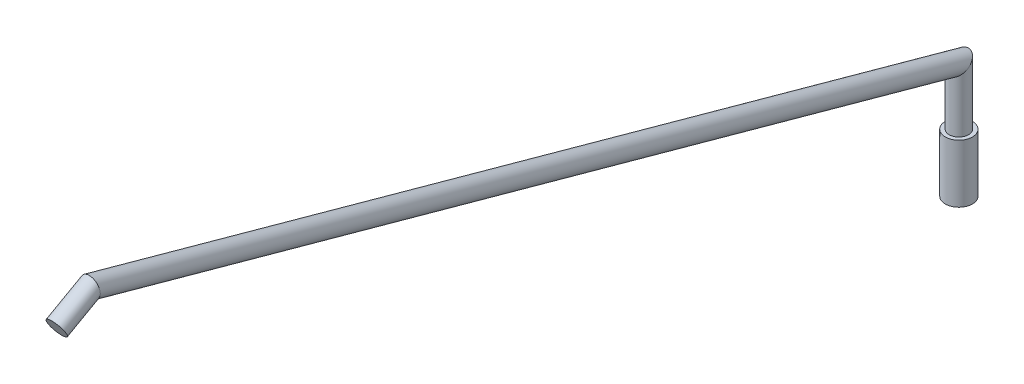
ISO-10303-21;
HEADER;
FILE_DESCRIPTION(('STEP AP214'),'2;1');
FILE_NAME('part.step','',(''),(''),'','','');
FILE_SCHEMA(('AUTOMOTIVE_DESIGN { 1 0 10303 214 1 1 1 1 }'));
ENDSEC;
DATA;
#1=APPLICATION_CONTEXT('core data for automotive mechanical design processes');
#2=APPLICATION_PROTOCOL_DEFINITION('international standard','automotive_design',2000,#1);
#3=PRODUCT_CONTEXT('',#1,'mechanical');
#4=PRODUCT('Part','Part','',(#3));
#5=PRODUCT_RELATED_PRODUCT_CATEGORY('part','',(#4));
#6=PRODUCT_DEFINITION_FORMATION('','',#4);
#7=PRODUCT_DEFINITION_CONTEXT('part definition',#1,'design');
#8=PRODUCT_DEFINITION('design','',#6,#7);
#9=PRODUCT_DEFINITION_SHAPE('','',#8);
#10=(LENGTH_UNIT() NAMED_UNIT(*) SI_UNIT(.MILLI.,.METRE.));
#11=(NAMED_UNIT(*) PLANE_ANGLE_UNIT() SI_UNIT($,.RADIAN.));
#12=(NAMED_UNIT(*) SI_UNIT($,.STERADIAN.) SOLID_ANGLE_UNIT());
#13=UNCERTAINTY_MEASURE_WITH_UNIT(LENGTH_MEASURE(1.E-05),#10,'distance_accuracy_value','');
#14=(GEOMETRIC_REPRESENTATION_CONTEXT(3) GLOBAL_UNCERTAINTY_ASSIGNED_CONTEXT((#13)) GLOBAL_UNIT_ASSIGNED_CONTEXT((#10,
#11,#12)) REPRESENTATION_CONTEXT('',''));
#15=CARTESIAN_POINT('',(0.,0.,0.));
#16=DIRECTION('',(0.,0.,1.));
#17=DIRECTION('',(1.,0.,0.));
#18=AXIS2_PLACEMENT_3D('',#15,#16,#17);
#19=CARTESIAN_POINT('',(0.,0.,0.));
#20=DIRECTION('',(0.,1.,0.));
#21=DIRECTION('',(0.,0.,1.));
#22=AXIS2_PLACEMENT_3D('',#19,#20,#21);
#23=CYLINDRICAL_SURFACE('',#22,2.5);
#24=CARTESIAN_POINT('',(0.,30.,0.));
#25=DIRECTION('',(0.,0.795616753938226,0.605800281324465));
#26=DIRECTION('',(0.,0.605800281324465,-0.795616753938226));
#27=AXIS2_PLACEMENT_3D('',#24,#25,#26);
#28=ELLIPSE('',#27,3.1422163844907,2.5);
#29=CARTESIAN_POINT('',(0.,31.9035555697068,-2.50000000000003));
#30=VERTEX_POINT('',#29);
#31=EDGE_CURVE('E10',#30,#30,#28,.F.);
#32=ORIENTED_EDGE('',*,*,#31,.T.);
#33=EDGE_LOOP('',(#32));
#34=FACE_BOUND('',#33,.T.);
#35=CARTESIAN_POINT('',(0.,15.,0.));
#36=DIRECTION('',(0.,-1.,0.));
#37=DIRECTION('',(0.,0.,-1.));
#38=AXIS2_PLACEMENT_3D('',#35,#36,#37);
#39=CIRCLE('',#38,2.5);
#40=CARTESIAN_POINT('',(0.,15.,-2.50000000000003));
#41=VERTEX_POINT('',#40);
#42=EDGE_CURVE('E38',#41,#41,#39,.F.);
#43=ORIENTED_EDGE('',*,*,#42,.T.);
#44=EDGE_LOOP('',(#43));
#45=FACE_BOUND('',#44,.T.);
#46=ADVANCED_FACE('F34',(#34,#45),#23,.T.);
#47=CARTESIAN_POINT('',(0.,87.,233.));
#48=DIRECTION('',(0.,-0.48904171388526,0.872260398092317));
#49=DIRECTION('',(0.,-0.872260398092317,-0.48904171388526));
#50=AXIS2_PLACEMENT_3D('',#47,#48,#49);
#51=PLANE('',#50);
#52=CARTESIAN_POINT('',(0.,87.,233.));
#53=DIRECTION('',(0.,-0.48904171388526,0.872260398092317));
#54=DIRECTION('',(0.,-0.872260398092317,-0.48904171388526));
#55=AXIS2_PLACEMENT_3D('',#52,#53,#54);
#56=CIRCLE('',#55,2.5);
#57=CARTESIAN_POINT('',(0.,84.8193490047692,231.777395715287));
#58=VERTEX_POINT('',#57);
#59=EDGE_CURVE('E47',#58,#58,#56,.T.);
#60=ORIENTED_EDGE('',*,*,#59,.T.);
#61=EDGE_LOOP('',(#60));
#62=FACE_BOUND('',#61,.T.);
#63=ADVANCED_FACE('F36',(#62),#51,.T.);
#64=CARTESIAN_POINT('',(0.,92.492326701668,223.203823233832));
#65=DIRECTION('',(0.,-0.48904171388526,0.872260398092317));
#66=DIRECTION('',(0.,-0.872260398092317,-0.48904171388526));
#67=AXIS2_PLACEMENT_3D('',#64,#65,#66);
#68=CYLINDRICAL_SURFACE('',#67,2.5);
#69=CARTESIAN_POINT('',(0.,91.8904171388527,224.277396019077));
#70=DIRECTION('',(0.,-0.120574493036413,0.992704282064408));
#71=DIRECTION('',(0.,0.992704282064408,0.120574493036413));
#72=AXIS2_PLACEMENT_3D('',#69,#70,#71);
#73=ELLIPSE('',#72,2.70310425545348,2.5);
#74=CARTESIAN_POINT('',(0.,94.5738003081078,224.603321444303));
#75=VERTEX_POINT('',#74);
#76=EDGE_CURVE('E42',#75,#75,#73,.F.);
#77=ORIENTED_EDGE('',*,*,#76,.F.);
#78=EDGE_LOOP('',(#77));
#79=FACE_BOUND('',#78,.T.);
#80=ORIENTED_EDGE('',*,*,#59,.F.);
#81=EDGE_LOOP('',(#80));
#82=FACE_BOUND('',#81,.T.);
#83=ADVANCED_FACE('F78',(#79,#82),#68,.T.);
#84=CARTESIAN_POINT('',(0.,29.4163932293558,-2.1148638653629));
#85=DIRECTION('',(0.,0.266012038294399,0.963969706724469));
#86=DIRECTION('',(0.,-0.963969706724469,0.266012038294399));
#87=AXIS2_PLACEMENT_3D('',#84,#85,#86);
#88=CYLINDRICAL_SURFACE('',#87,2.5);
#89=ORIENTED_EDGE('',*,*,#31,.F.);
#90=EDGE_LOOP('',(#89));
#91=FACE_BOUND('',#90,.T.);
#92=ORIENTED_EDGE('',*,*,#76,.T.);
#93=EDGE_LOOP('',(#92));
#94=FACE_BOUND('',#93,.T.);
#95=ADVANCED_FACE('F70',(#91,#94),#88,.T.);
#96=CARTESIAN_POINT('',(0.,15.,0.));
#97=DIRECTION('',(0.,-1.,0.));
#98=DIRECTION('',(0.,0.,-1.));
#99=AXIS2_PLACEMENT_3D('',#96,#97,#98);
#100=CYLINDRICAL_SURFACE('',#99,3.5);
#101=CARTESIAN_POINT('',(0.,15.,0.));
#102=DIRECTION('',(0.,-1.,0.));
#103=DIRECTION('',(0.,0.,-1.));
#104=AXIS2_PLACEMENT_3D('',#101,#102,#103);
#105=CIRCLE('',#104,3.5);
#106=CARTESIAN_POINT('',(0.,15.,-3.50000000000002));
#107=VERTEX_POINT('',#106);
#108=EDGE_CURVE('E56',#107,#107,#105,.T.);
#109=ORIENTED_EDGE('',*,*,#108,.T.);
#110=EDGE_LOOP('',(#109));
#111=FACE_BOUND('',#110,.T.);
#112=CARTESIAN_POINT('',(0.,0.,0.));
#113=DIRECTION('',(0.,-1.,0.));
#114=DIRECTION('',(0.,0.,-1.));
#115=AXIS2_PLACEMENT_3D('',#112,#113,#114);
#116=CIRCLE('',#115,3.5);
#117=CARTESIAN_POINT('',(0.,0.,-3.50000000000003));
#118=VERTEX_POINT('',#117);
#119=EDGE_CURVE('E50',#118,#118,#116,.T.);
#120=ORIENTED_EDGE('',*,*,#119,.F.);
#121=EDGE_LOOP('',(#120));
#122=FACE_BOUND('',#121,.T.);
#123=ADVANCED_FACE('F67',(#111,#122),#100,.T.);
#124=CARTESIAN_POINT('',(0.,15.,0.));
#125=DIRECTION('',(0.,-1.,0.));
#126=DIRECTION('',(0.,0.,-1.));
#127=AXIS2_PLACEMENT_3D('',#124,#125,#126);
#128=PLANE('',#127);
#129=ORIENTED_EDGE('',*,*,#42,.F.);
#130=EDGE_LOOP('',(#129));
#131=FACE_BOUND('',#130,.T.);
#132=ORIENTED_EDGE('',*,*,#108,.F.);
#133=EDGE_LOOP('',(#132));
#134=FACE_BOUND('',#133,.T.);
#135=ADVANCED_FACE('F69',(#131,#134),#128,.F.);
#136=CARTESIAN_POINT('',(0.,0.,0.));
#137=DIRECTION('',(0.,1.,0.));
#138=DIRECTION('',(0.,0.,1.));
#139=AXIS2_PLACEMENT_3D('',#136,#137,#138);
#140=PLANE('',#139);
#141=ORIENTED_EDGE('',*,*,#119,.T.);
#142=EDGE_LOOP('',(#141));
#143=FACE_BOUND('',#142,.T.);
#144=ADVANCED_FACE('F65',(#143),#140,.F.);
#145=CLOSED_SHELL('',(#46,#63,#83,#95,#123,#135,#144));
#146=MANIFOLD_SOLID_BREP('B2',#145);
#147=ADVANCED_BREP_SHAPE_REPRESENTATION('',(#18,#146),#14);
#148=SHAPE_DEFINITION_REPRESENTATION(#9,#147);
ENDSEC;
END-ISO-10303-21;
